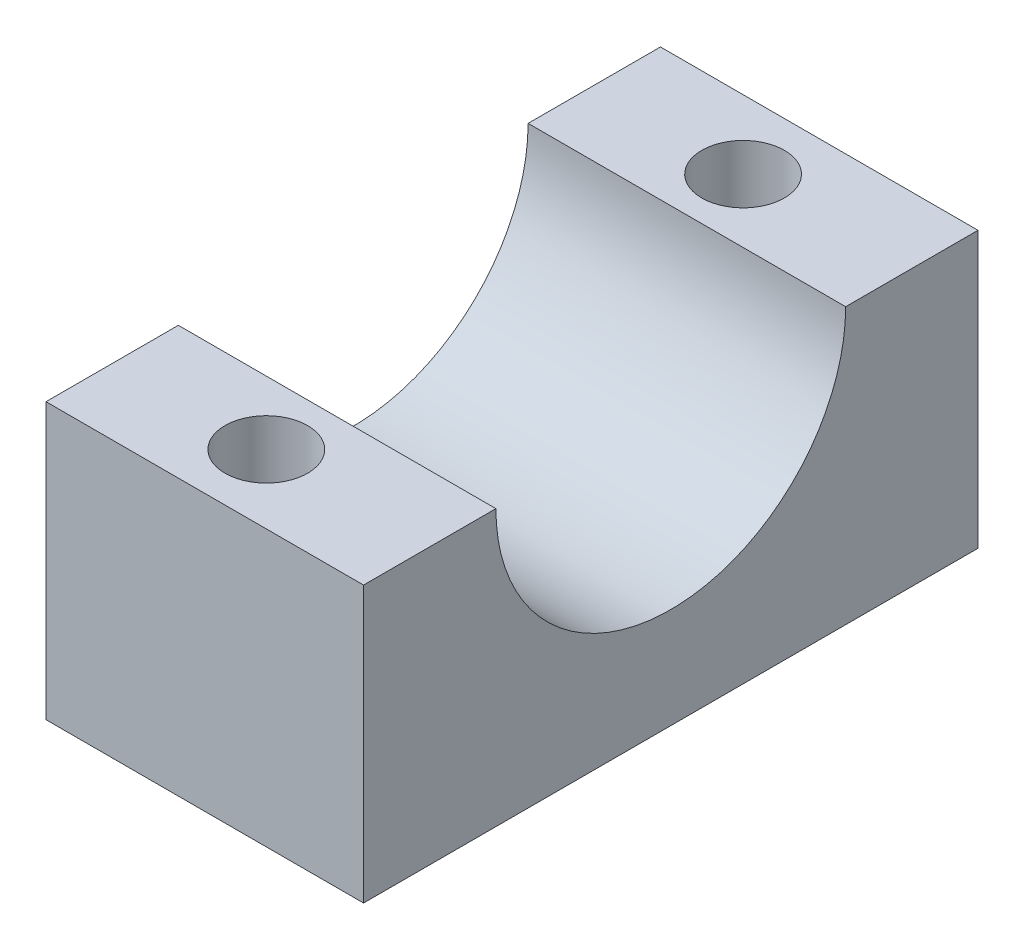
ISO-10303-21;
HEADER;
FILE_DESCRIPTION(('STEP AP214'),'2;1');
FILE_NAME('part.step','',(''),(''),'','','');
FILE_SCHEMA(('AUTOMOTIVE_DESIGN { 1 0 10303 214 1 1 1 1 }'));
ENDSEC;
DATA;
#1=APPLICATION_CONTEXT('core data for automotive mechanical design processes');
#2=APPLICATION_PROTOCOL_DEFINITION('international standard','automotive_design',2000,#1);
#3=PRODUCT_CONTEXT('',#1,'mechanical');
#4=PRODUCT('Part','Part','',(#3));
#5=PRODUCT_RELATED_PRODUCT_CATEGORY('part','',(#4));
#6=PRODUCT_DEFINITION_FORMATION('','',#4);
#7=PRODUCT_DEFINITION_CONTEXT('part definition',#1,'design');
#8=PRODUCT_DEFINITION('design','',#6,#7);
#9=PRODUCT_DEFINITION_SHAPE('','',#8);
#10=(LENGTH_UNIT() NAMED_UNIT(*) SI_UNIT(.MILLI.,.METRE.));
#11=(NAMED_UNIT(*) PLANE_ANGLE_UNIT() SI_UNIT($,.RADIAN.));
#12=(NAMED_UNIT(*) SI_UNIT($,.STERADIAN.) SOLID_ANGLE_UNIT());
#13=UNCERTAINTY_MEASURE_WITH_UNIT(LENGTH_MEASURE(1.E-05),#10,'distance_accuracy_value','');
#14=(GEOMETRIC_REPRESENTATION_CONTEXT(3) GLOBAL_UNCERTAINTY_ASSIGNED_CONTEXT((#13)) GLOBAL_UNIT_ASSIGNED_CONTEXT((#10,
#11,#12)) REPRESENTATION_CONTEXT('',''));
#15=CARTESIAN_POINT('',(0.,0.,0.));
#16=DIRECTION('',(0.,0.,1.));
#17=DIRECTION('',(1.,0.,0.));
#18=AXIS2_PLACEMENT_3D('',#15,#16,#17);
#19=CARTESIAN_POINT('',(11.53,5.,0.));
#20=DIRECTION('',(-1.,0.,0.));
#21=DIRECTION('',(0.,0.,1.));
#22=AXIS2_PLACEMENT_3D('',#19,#20,#21);
#23=CYLINDRICAL_SURFACE('',#22,6.35);
#24=CARTESIAN_POINT('',(0.,5.,0.));
#25=DIRECTION('',(1.,0.,0.));
#26=DIRECTION('',(0.,0.,-1.));
#27=AXIS2_PLACEMENT_3D('',#24,#25,#26);
#28=CIRCLE('',#27,6.35);
#29=CARTESIAN_POINT('',(0.,5.,6.35));
#30=VERTEX_POINT('',#29);
#31=CARTESIAN_POINT('',(0.,5.,-6.35));
#32=VERTEX_POINT('',#31);
#33=EDGE_CURVE('E121',#30,#32,#28,.T.);
#34=ORIENTED_EDGE('',*,*,#33,.F.);
#35=DIRECTION('',(-1.,0.,0.));
#36=VECTOR('',#35,1.);
#37=CARTESIAN_POINT('',(11.53,5.,6.35));
#38=LINE('',#37,#36);
#39=CARTESIAN_POINT('',(11.53,5.,6.35));
#40=VERTEX_POINT('',#39);
#41=EDGE_CURVE('E11',#40,#30,#38,.T.);
#42=ORIENTED_EDGE('',*,*,#41,.F.);
#43=CARTESIAN_POINT('',(11.53,5.,0.));
#44=DIRECTION('',(1.,0.,0.));
#45=DIRECTION('',(0.,0.,-1.));
#46=AXIS2_PLACEMENT_3D('',#43,#44,#45);
#47=CIRCLE('',#46,6.35);
#48=CARTESIAN_POINT('',(11.53,5.,-6.35));
#49=VERTEX_POINT('',#48);
#50=EDGE_CURVE('E146',#40,#49,#47,.T.);
#51=ORIENTED_EDGE('',*,*,#50,.T.);
#52=DIRECTION('',(-1.,0.,0.));
#53=VECTOR('',#52,1.);
#54=CARTESIAN_POINT('',(11.53,5.,-6.35));
#55=LINE('',#54,#53);
#56=EDGE_CURVE('E54',#49,#32,#55,.T.);
#57=ORIENTED_EDGE('',*,*,#56,.T.);
#58=EDGE_LOOP('',(#34,#42,#51,#57));
#59=FACE_BOUND('',#58,.T.);
#60=ADVANCED_FACE('F38',(#59),#23,.F.);
#61=CARTESIAN_POINT('',(11.53,5.,0.));
#62=DIRECTION('',(0.,1.,0.));
#63=DIRECTION('',(0.,0.,1.));
#64=AXIS2_PLACEMENT_3D('',#61,#62,#63);
#65=PLANE('',#64);
#66=CARTESIAN_POINT('',(5.5,5.,8.655));
#67=DIRECTION('',(0.,1.,0.));
#68=DIRECTION('',(0.,0.,1.));
#69=AXIS2_PLACEMENT_3D('',#66,#67,#68);
#70=CIRCLE('',#69,1.5);
#71=CARTESIAN_POINT('',(5.5,5.,10.155));
#72=VERTEX_POINT('',#71);
#73=EDGE_CURVE('E155',#72,#72,#70,.T.);
#74=ORIENTED_EDGE('',*,*,#73,.F.);
#75=EDGE_LOOP('',(#74));
#76=FACE_BOUND('',#75,.T.);
#77=DIRECTION('',(0.,0.,-1.));
#78=VECTOR('',#77,1.);
#79=CARTESIAN_POINT('',(0.,5.,0.));
#80=LINE('',#79,#78);
#81=CARTESIAN_POINT('',(0.,5.,11.155));
#82=VERTEX_POINT('',#81);
#83=EDGE_CURVE('E123',#82,#30,#80,.T.);
#84=ORIENTED_EDGE('',*,*,#83,.F.);
#85=DIRECTION('',(-1.,0.,0.));
#86=VECTOR('',#85,1.);
#87=CARTESIAN_POINT('',(11.53,5.,11.155));
#88=LINE('',#87,#86);
#89=CARTESIAN_POINT('',(11.53,5.,11.155));
#90=VERTEX_POINT('',#89);
#91=EDGE_CURVE('E46',#90,#82,#88,.T.);
#92=ORIENTED_EDGE('',*,*,#91,.F.);
#93=DIRECTION('',(0.,0.,-1.));
#94=VECTOR('',#93,1.);
#95=CARTESIAN_POINT('',(11.53,5.,0.));
#96=LINE('',#95,#94);
#97=EDGE_CURVE('E118',#90,#40,#96,.T.);
#98=ORIENTED_EDGE('',*,*,#97,.T.);
#99=ORIENTED_EDGE('',*,*,#41,.T.);
#100=EDGE_LOOP('',(#84,#92,#98,#99));
#101=FACE_BOUND('',#100,.T.);
#102=ADVANCED_FACE('F143',(#76,#101),#65,.T.);
#103=CARTESIAN_POINT('',(11.53,0.,11.155));
#104=DIRECTION('',(0.,0.,-1.));
#105=DIRECTION('',(-1.,0.,0.));
#106=AXIS2_PLACEMENT_3D('',#103,#104,#105);
#107=PLANE('',#106);
#108=DIRECTION('',(0.,-1.,0.));
#109=VECTOR('',#108,1.);
#110=CARTESIAN_POINT('',(0.,0.,11.155));
#111=LINE('',#110,#109);
#112=CARTESIAN_POINT('',(0.,-5.,11.155));
#113=VERTEX_POINT('',#112);
#114=EDGE_CURVE('E127',#82,#113,#111,.T.);
#115=ORIENTED_EDGE('',*,*,#114,.T.);
#116=DIRECTION('',(-1.,0.,0.));
#117=VECTOR('',#116,1.);
#118=CARTESIAN_POINT('',(11.53,-5.,11.155));
#119=LINE('',#118,#117);
#120=CARTESIAN_POINT('',(11.53,-5.,11.155));
#121=VERTEX_POINT('',#120);
#122=EDGE_CURVE('E112',#121,#113,#119,.T.);
#123=ORIENTED_EDGE('',*,*,#122,.F.);
#124=DIRECTION('',(0.,-1.,0.));
#125=VECTOR('',#124,1.);
#126=CARTESIAN_POINT('',(11.53,0.,11.155));
#127=LINE('',#126,#125);
#128=EDGE_CURVE('E100',#90,#121,#127,.T.);
#129=ORIENTED_EDGE('',*,*,#128,.F.);
#130=ORIENTED_EDGE('',*,*,#91,.T.);
#131=EDGE_LOOP('',(#115,#123,#129,#130));
#132=FACE_BOUND('',#131,.T.);
#133=ADVANCED_FACE('F137',(#132),#107,.F.);
#134=CARTESIAN_POINT('',(11.53,-5.,0.));
#135=DIRECTION('',(0.,1.,0.));
#136=DIRECTION('',(0.,0.,1.));
#137=AXIS2_PLACEMENT_3D('',#134,#135,#136);
#138=PLANE('',#137);
#139=CARTESIAN_POINT('',(5.5,-5.,8.655));
#140=DIRECTION('',(0.,1.,0.));
#141=DIRECTION('',(0.,0.,1.));
#142=AXIS2_PLACEMENT_3D('',#139,#140,#141);
#143=CIRCLE('',#142,1.5);
#144=CARTESIAN_POINT('',(5.5,-5.,10.155));
#145=VERTEX_POINT('',#144);
#146=EDGE_CURVE('E124',#145,#145,#143,.T.);
#147=ORIENTED_EDGE('',*,*,#146,.T.);
#148=EDGE_LOOP('',(#147));
#149=FACE_BOUND('',#148,.T.);
#150=CARTESIAN_POINT('',(5.5,-5.,-8.655));
#151=DIRECTION('',(0.,1.,0.));
#152=DIRECTION('',(0.,0.,1.));
#153=AXIS2_PLACEMENT_3D('',#150,#151,#152);
#154=CIRCLE('',#153,1.5);
#155=CARTESIAN_POINT('',(5.5,-5.,-7.155));
#156=VERTEX_POINT('',#155);
#157=EDGE_CURVE('E152',#156,#156,#154,.T.);
#158=ORIENTED_EDGE('',*,*,#157,.T.);
#159=EDGE_LOOP('',(#158));
#160=FACE_BOUND('',#159,.T.);
#161=DIRECTION('',(0.,0.,-1.));
#162=VECTOR('',#161,1.);
#163=CARTESIAN_POINT('',(0.,-5.,0.));
#164=LINE('',#163,#162);
#165=CARTESIAN_POINT('',(0.,-5.,-11.155));
#166=VERTEX_POINT('',#165);
#167=EDGE_CURVE('E109',#113,#166,#164,.T.);
#168=ORIENTED_EDGE('',*,*,#167,.T.);
#169=DIRECTION('',(-1.,0.,0.));
#170=VECTOR('',#169,1.);
#171=CARTESIAN_POINT('',(11.53,-5.,-11.155));
#172=LINE('',#171,#170);
#173=CARTESIAN_POINT('',(11.53,-5.,-11.155));
#174=VERTEX_POINT('',#173);
#175=EDGE_CURVE('E106',#174,#166,#172,.T.);
#176=ORIENTED_EDGE('',*,*,#175,.F.);
#177=DIRECTION('',(0.,0.,-1.));
#178=VECTOR('',#177,1.);
#179=CARTESIAN_POINT('',(11.53,-5.,0.));
#180=LINE('',#179,#178);
#181=EDGE_CURVE('E92',#121,#174,#180,.T.);
#182=ORIENTED_EDGE('',*,*,#181,.F.);
#183=ORIENTED_EDGE('',*,*,#122,.T.);
#184=EDGE_LOOP('',(#168,#176,#182,#183));
#185=FACE_BOUND('',#184,.T.);
#186=ADVANCED_FACE('F107',(#149,#160,#185),#138,.F.);
#187=CARTESIAN_POINT('',(11.53,0.,-11.155));
#188=DIRECTION('',(0.,0.,1.));
#189=DIRECTION('',(1.,0.,0.));
#190=AXIS2_PLACEMENT_3D('',#187,#188,#189);
#191=PLANE('',#190);
#192=DIRECTION('',(0.,1.,0.));
#193=VECTOR('',#192,1.);
#194=CARTESIAN_POINT('',(0.,0.,-11.155));
#195=LINE('',#194,#193);
#196=CARTESIAN_POINT('',(0.,5.,-11.155));
#197=VERTEX_POINT('',#196);
#198=EDGE_CURVE('E131',#166,#197,#195,.T.);
#199=ORIENTED_EDGE('',*,*,#198,.T.);
#200=DIRECTION('',(-1.,0.,0.));
#201=VECTOR('',#200,1.);
#202=CARTESIAN_POINT('',(11.53,5.,-11.155));
#203=LINE('',#202,#201);
#204=CARTESIAN_POINT('',(11.53,5.,-11.155));
#205=VERTEX_POINT('',#204);
#206=EDGE_CURVE('E74',#205,#197,#203,.T.);
#207=ORIENTED_EDGE('',*,*,#206,.F.);
#208=DIRECTION('',(0.,1.,0.));
#209=VECTOR('',#208,1.);
#210=CARTESIAN_POINT('',(11.53,0.,-11.155));
#211=LINE('',#210,#209);
#212=EDGE_CURVE('E97',#174,#205,#211,.T.);
#213=ORIENTED_EDGE('',*,*,#212,.F.);
#214=ORIENTED_EDGE('',*,*,#175,.T.);
#215=EDGE_LOOP('',(#199,#207,#213,#214));
#216=FACE_BOUND('',#215,.T.);
#217=ADVANCED_FACE('F114',(#216),#191,.F.);
#218=CARTESIAN_POINT('',(5.5,5.,-8.655));
#219=DIRECTION('',(0.,1.,0.));
#220=DIRECTION('',(0.,0.,1.));
#221=AXIS2_PLACEMENT_3D('',#218,#219,#220);
#222=CIRCLE('',#221,1.5);
#223=CARTESIAN_POINT('',(5.5,5.,-7.155));
#224=VERTEX_POINT('',#223);
#225=EDGE_CURVE('E149',#224,#224,#222,.T.);
#226=ORIENTED_EDGE('',*,*,#225,.F.);
#227=EDGE_LOOP('',(#226));
#228=FACE_BOUND('',#227,.T.);
#229=EDGE_CURVE('E128',#32,#197,#80,.T.);
#230=ORIENTED_EDGE('',*,*,#229,.F.);
#231=ORIENTED_EDGE('',*,*,#56,.F.);
#232=EDGE_CURVE('E115',#49,#205,#96,.T.);
#233=ORIENTED_EDGE('',*,*,#232,.T.);
#234=ORIENTED_EDGE('',*,*,#206,.T.);
#235=EDGE_LOOP('',(#230,#231,#233,#234));
#236=FACE_BOUND('',#235,.T.);
#237=ADVANCED_FACE('F145',(#228,#236),#65,.T.);
#238=CARTESIAN_POINT('',(11.53,0.,0.));
#239=DIRECTION('',(1.,0.,0.));
#240=DIRECTION('',(0.,0.,-1.));
#241=AXIS2_PLACEMENT_3D('',#238,#239,#240);
#242=PLANE('',#241);
#243=ORIENTED_EDGE('',*,*,#50,.F.);
#244=ORIENTED_EDGE('',*,*,#97,.F.);
#245=ORIENTED_EDGE('',*,*,#128,.T.);
#246=ORIENTED_EDGE('',*,*,#181,.T.);
#247=ORIENTED_EDGE('',*,*,#212,.T.);
#248=ORIENTED_EDGE('',*,*,#232,.F.);
#249=EDGE_LOOP('',(#243,#244,#245,#246,#247,#248));
#250=FACE_BOUND('',#249,.T.);
#251=ADVANCED_FACE('F94',(#250),#242,.T.);
#252=CARTESIAN_POINT('',(0.,0.,0.));
#253=DIRECTION('',(1.,0.,0.));
#254=DIRECTION('',(0.,0.,-1.));
#255=AXIS2_PLACEMENT_3D('',#252,#253,#254);
#256=PLANE('',#255);
#257=ORIENTED_EDGE('',*,*,#33,.T.);
#258=ORIENTED_EDGE('',*,*,#229,.T.);
#259=ORIENTED_EDGE('',*,*,#198,.F.);
#260=ORIENTED_EDGE('',*,*,#167,.F.);
#261=ORIENTED_EDGE('',*,*,#114,.F.);
#262=ORIENTED_EDGE('',*,*,#83,.T.);
#263=EDGE_LOOP('',(#257,#258,#259,#260,#261,#262));
#264=FACE_BOUND('',#263,.T.);
#265=ADVANCED_FACE('F142',(#264),#256,.F.);
#266=CARTESIAN_POINT('',(5.5,-5.,-8.655));
#267=DIRECTION('',(0.,1.,0.));
#268=DIRECTION('',(0.,0.,1.));
#269=AXIS2_PLACEMENT_3D('',#266,#267,#268);
#270=CYLINDRICAL_SURFACE('',#269,1.5);
#271=ORIENTED_EDGE('',*,*,#157,.F.);
#272=EDGE_LOOP('',(#271));
#273=FACE_BOUND('',#272,.T.);
#274=ORIENTED_EDGE('',*,*,#225,.T.);
#275=EDGE_LOOP('',(#274));
#276=FACE_BOUND('',#275,.T.);
#277=ADVANCED_FACE('F166',(#273,#276),#270,.F.);
#278=CARTESIAN_POINT('',(5.5,-5.,8.655));
#279=DIRECTION('',(0.,1.,0.));
#280=DIRECTION('',(0.,0.,1.));
#281=AXIS2_PLACEMENT_3D('',#278,#279,#280);
#282=CYLINDRICAL_SURFACE('',#281,1.5);
#283=ORIENTED_EDGE('',*,*,#146,.F.);
#284=EDGE_LOOP('',(#283));
#285=FACE_BOUND('',#284,.T.);
#286=ORIENTED_EDGE('',*,*,#73,.T.);
#287=EDGE_LOOP('',(#286));
#288=FACE_BOUND('',#287,.T.);
#289=ADVANCED_FACE('F163',(#285,#288),#282,.F.);
#290=CLOSED_SHELL('',(#60,#102,#133,#186,#217,#237,#251,#265,#277,#289));
#291=MANIFOLD_SOLID_BREP('B2',#290);
#292=ADVANCED_BREP_SHAPE_REPRESENTATION('',(#18,#291),#14);
#293=SHAPE_DEFINITION_REPRESENTATION(#9,#292);
ENDSEC;
END-ISO-10303-21;
